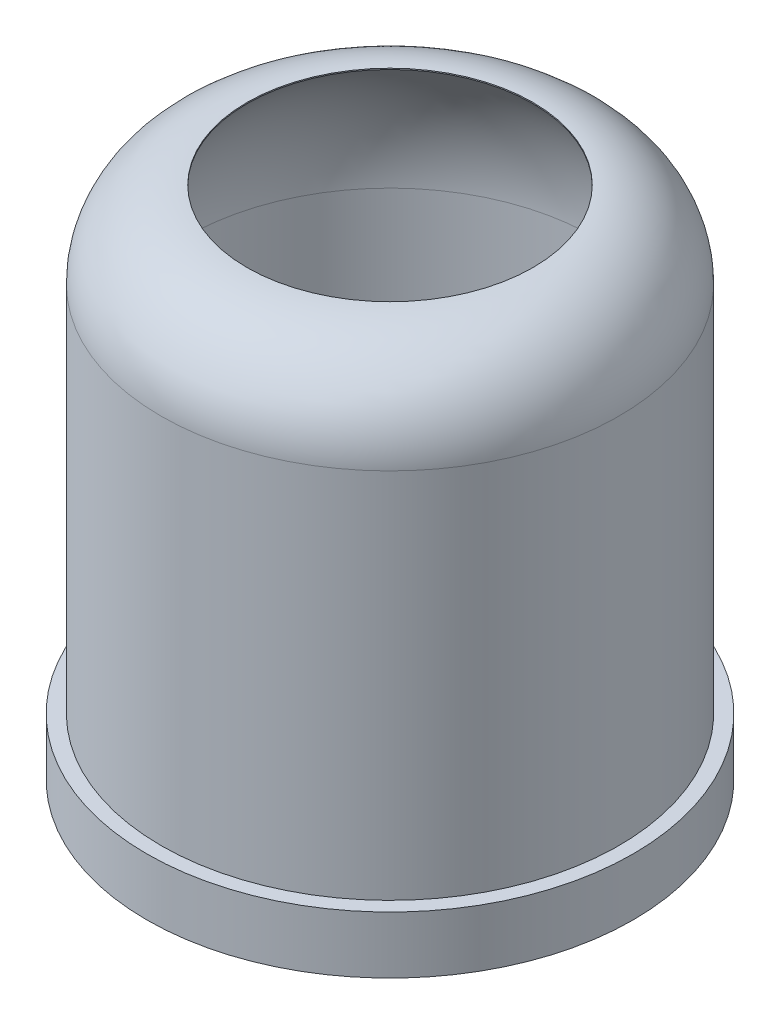
ISO-10303-21;
HEADER;
FILE_DESCRIPTION(('STEP AP214'),'2;1');
FILE_NAME('part.step','',(''),(''),'','','');
FILE_SCHEMA(('AUTOMOTIVE_DESIGN { 1 0 10303 214 1 1 1 1 }'));
ENDSEC;
DATA;
#1=APPLICATION_CONTEXT('core data for automotive mechanical design processes');
#2=APPLICATION_PROTOCOL_DEFINITION('international standard','automotive_design',2000,#1);
#3=PRODUCT_CONTEXT('',#1,'mechanical');
#4=PRODUCT('Part','Part','',(#3));
#5=PRODUCT_RELATED_PRODUCT_CATEGORY('part','',(#4));
#6=PRODUCT_DEFINITION_FORMATION('','',#4);
#7=PRODUCT_DEFINITION_CONTEXT('part definition',#1,'design');
#8=PRODUCT_DEFINITION('design','',#6,#7);
#9=PRODUCT_DEFINITION_SHAPE('','',#8);
#10=(LENGTH_UNIT() NAMED_UNIT(*) SI_UNIT(.MILLI.,.METRE.));
#11=(NAMED_UNIT(*) PLANE_ANGLE_UNIT() SI_UNIT($,.RADIAN.));
#12=(NAMED_UNIT(*) SI_UNIT($,.STERADIAN.) SOLID_ANGLE_UNIT());
#13=UNCERTAINTY_MEASURE_WITH_UNIT(LENGTH_MEASURE(1.E-05),#10,'distance_accuracy_value','');
#14=(GEOMETRIC_REPRESENTATION_CONTEXT(3) GLOBAL_UNCERTAINTY_ASSIGNED_CONTEXT((#13)) GLOBAL_UNIT_ASSIGNED_CONTEXT((#10,
#11,#12)) REPRESENTATION_CONTEXT('',''));
#15=CARTESIAN_POINT('',(0.,0.,0.));
#16=DIRECTION('',(0.,0.,1.));
#17=DIRECTION('',(1.,0.,0.));
#18=AXIS2_PLACEMENT_3D('',#15,#16,#17);
#19=CARTESIAN_POINT('',(0.,4.5,0.));
#20=DIRECTION('',(0.,1.,0.));
#21=DIRECTION('',(0.,0.,1.));
#22=AXIS2_PLACEMENT_3D('',#19,#20,#21);
#23=CYLINDRICAL_SURFACE('',#22,4.25);
#24=CARTESIAN_POINT('',(0.,-4.5,0.));
#25=DIRECTION('',(0.,1.,0.));
#26=DIRECTION('',(0.,0.,1.));
#27=AXIS2_PLACEMENT_3D('',#24,#25,#26);
#28=CIRCLE('',#27,4.25);
#29=CARTESIAN_POINT('',(0.,-4.5,4.25));
#30=VERTEX_POINT('',#29);
#31=EDGE_CURVE('E59',#30,#30,#28,.T.);
#32=ORIENTED_EDGE('',*,*,#31,.T.);
#33=EDGE_LOOP('',(#32));
#34=FACE_BOUND('',#33,.T.);
#35=CARTESIAN_POINT('',(0.,-3.5,0.));
#36=DIRECTION('',(0.,1.,0.));
#37=DIRECTION('',(0.,0.,1.));
#38=AXIS2_PLACEMENT_3D('',#35,#36,#37);
#39=CIRCLE('',#38,4.25);
#40=CARTESIAN_POINT('',(0.,-3.5,4.25));
#41=VERTEX_POINT('',#40);
#42=EDGE_CURVE('E10',#41,#41,#39,.T.);
#43=ORIENTED_EDGE('',*,*,#42,.F.);
#44=EDGE_LOOP('',(#43));
#45=FACE_BOUND('',#44,.T.);
#46=ADVANCED_FACE('F28',(#34,#45),#23,.T.);
#47=CARTESIAN_POINT('',(-4.25,-3.5,0.));
#48=DIRECTION('',(0.,1.,0.));
#49=DIRECTION('',(0.,0.,1.));
#50=AXIS2_PLACEMENT_3D('',#47,#48,#49);
#51=PLANE('',#50);
#52=ORIENTED_EDGE('',*,*,#42,.T.);
#53=EDGE_LOOP('',(#52));
#54=FACE_BOUND('',#53,.T.);
#55=CARTESIAN_POINT('',(0.,-3.5,0.));
#56=DIRECTION('',(0.,1.,0.));
#57=DIRECTION('',(0.,0.,1.));
#58=AXIS2_PLACEMENT_3D('',#55,#56,#57);
#59=CIRCLE('',#58,4.);
#60=CARTESIAN_POINT('',(0.,-3.5,4.));
#61=VERTEX_POINT('',#60);
#62=EDGE_CURVE('E34',#61,#61,#59,.T.);
#63=ORIENTED_EDGE('',*,*,#62,.F.);
#64=EDGE_LOOP('',(#63));
#65=FACE_BOUND('',#64,.T.);
#66=ADVANCED_FACE('F77',(#54,#65),#51,.T.);
#67=CARTESIAN_POINT('',(0.,4.5,0.));
#68=DIRECTION('',(0.,1.,0.));
#69=DIRECTION('',(0.,0.,1.));
#70=AXIS2_PLACEMENT_3D('',#67,#68,#69);
#71=CYLINDRICAL_SURFACE('',#70,4.);
#72=ORIENTED_EDGE('',*,*,#62,.T.);
#73=EDGE_LOOP('',(#72));
#74=FACE_BOUND('',#73,.T.);
#75=CARTESIAN_POINT('',(0.,3.,0.));
#76=DIRECTION('',(0.,1.,0.));
#77=DIRECTION('',(0.,0.,1.));
#78=AXIS2_PLACEMENT_3D('',#75,#76,#77);
#79=CIRCLE('',#78,4.);
#80=CARTESIAN_POINT('',(0.,3.,4.));
#81=VERTEX_POINT('',#80);
#82=EDGE_CURVE('E38',#81,#81,#79,.T.);
#83=ORIENTED_EDGE('',*,*,#82,.F.);
#84=EDGE_LOOP('',(#83));
#85=FACE_BOUND('',#84,.T.);
#86=ADVANCED_FACE('F81',(#74,#85),#71,.T.);
#87=CARTESIAN_POINT('',(0.,3.,0.));
#88=DIRECTION('',(0.,1.,0.));
#89=DIRECTION('',(0.,0.,1.));
#90=AXIS2_PLACEMENT_3D('',#87,#88,#89);
#91=TOROIDAL_SURFACE('',#90,2.5,1.5);
#92=ORIENTED_EDGE('',*,*,#82,.T.);
#93=EDGE_LOOP('',(#92));
#94=FACE_BOUND('',#93,.T.);
#95=CARTESIAN_POINT('',(0.,4.5,0.));
#96=DIRECTION('',(0.,1.,0.));
#97=DIRECTION('',(0.,0.,1.));
#98=AXIS2_PLACEMENT_3D('',#95,#96,#97);
#99=CIRCLE('',#98,2.5);
#100=CARTESIAN_POINT('',(0.,4.5,2.5));
#101=VERTEX_POINT('',#100);
#102=EDGE_CURVE('E42',#101,#101,#99,.T.);
#103=ORIENTED_EDGE('',*,*,#102,.F.);
#104=EDGE_LOOP('',(#103));
#105=FACE_BOUND('',#104,.T.);
#106=ADVANCED_FACE('F85',(#94,#105),#91,.T.);
#107=CARTESIAN_POINT('',(0.,4.5,0.));
#108=DIRECTION('',(0.,1.,0.));
#109=DIRECTION('',(0.,0.,1.));
#110=AXIS2_PLACEMENT_3D('',#107,#108,#109);
#111=CYLINDRICAL_SURFACE('',#110,2.5);
#112=ORIENTED_EDGE('',*,*,#102,.T.);
#113=EDGE_LOOP('',(#112));
#114=FACE_BOUND('',#113,.T.);
#115=CARTESIAN_POINT('',(0.,4.48050875561012,0.));
#116=DIRECTION('',(0.,1.,0.));
#117=DIRECTION('',(0.,0.,1.));
#118=AXIS2_PLACEMENT_3D('',#115,#116,#117);
#119=CIRCLE('',#118,2.5);
#120=CARTESIAN_POINT('',(0.,4.48050875561012,2.5));
#121=VERTEX_POINT('',#120);
#122=EDGE_CURVE('E47',#121,#121,#119,.T.);
#123=ORIENTED_EDGE('',*,*,#122,.F.);
#124=EDGE_LOOP('',(#123));
#125=FACE_BOUND('',#124,.T.);
#126=ADVANCED_FACE('F91',(#114,#125),#111,.F.);
#127=CARTESIAN_POINT('',(0.,1.925,0.));
#128=DIRECTION('',(0.,1.,0.));
#129=DIRECTION('',(-1.,0.,0.));
#130=AXIS2_PLACEMENT_3D('',#127,#128,#129);
#131=SPHERICAL_SURFACE('',#130,3.575);
#132=ORIENTED_EDGE('',*,*,#122,.T.);
#133=EDGE_LOOP('',(#132));
#134=FACE_BOUND('',#133,.T.);
#135=CARTESIAN_POINT('',(0.,1.92499999999997,0.));
#136=DIRECTION('',(0.,1.,0.));
#137=DIRECTION('',(0.,0.,1.));
#138=AXIS2_PLACEMENT_3D('',#135,#136,#137);
#139=CIRCLE('',#138,3.575);
#140=CARTESIAN_POINT('',(0.,1.92499999999997,3.575));
#141=VERTEX_POINT('',#140);
#142=EDGE_CURVE('E50',#141,#141,#139,.T.);
#143=ORIENTED_EDGE('',*,*,#142,.F.);
#144=EDGE_LOOP('',(#143));
#145=FACE_BOUND('',#144,.T.);
#146=ADVANCED_FACE('F95',(#134,#145),#131,.F.);
#147=CARTESIAN_POINT('',(0.,4.5,0.));
#148=DIRECTION('',(0.,1.,0.));
#149=DIRECTION('',(0.,0.,1.));
#150=AXIS2_PLACEMENT_3D('',#147,#148,#149);
#151=CYLINDRICAL_SURFACE('',#150,3.575);
#152=ORIENTED_EDGE('',*,*,#142,.T.);
#153=EDGE_LOOP('',(#152));
#154=FACE_BOUND('',#153,.T.);
#155=CARTESIAN_POINT('',(0.,-2.76362446458147,0.));
#156=DIRECTION('',(0.,1.,0.));
#157=DIRECTION('',(0.,0.,1.));
#158=AXIS2_PLACEMENT_3D('',#155,#156,#157);
#159=CIRCLE('',#158,3.575);
#160=CARTESIAN_POINT('',(0.,-2.76362446458147,3.575));
#161=VERTEX_POINT('',#160);
#162=EDGE_CURVE('E53',#161,#161,#159,.T.);
#163=ORIENTED_EDGE('',*,*,#162,.F.);
#164=EDGE_LOOP('',(#163));
#165=FACE_BOUND('',#164,.T.);
#166=ADVANCED_FACE('F73',(#154,#165),#151,.F.);
#167=CARTESIAN_POINT('',(0.,-2.76362446458147,0.));
#168=DIRECTION('',(0.,1.,0.));
#169=DIRECTION('',(-1.,0.,0.));
#170=AXIS2_PLACEMENT_3D('',#167,#168,#169);
#171=SPHERICAL_SURFACE('',#170,3.575);
#172=ORIENTED_EDGE('',*,*,#162,.T.);
#173=EDGE_LOOP('',(#172));
#174=FACE_BOUND('',#173,.T.);
#175=CARTESIAN_POINT('',(0.,-4.5,0.));
#176=DIRECTION('',(0.,1.,0.));
#177=DIRECTION('',(0.,0.,1.));
#178=AXIS2_PLACEMENT_3D('',#175,#176,#177);
#179=CIRCLE('',#178,3.125);
#180=CARTESIAN_POINT('',(0.,-4.5,3.125));
#181=VERTEX_POINT('',#180);
#182=EDGE_CURVE('E56',#181,#181,#179,.T.);
#183=ORIENTED_EDGE('',*,*,#182,.F.);
#184=EDGE_LOOP('',(#183));
#185=FACE_BOUND('',#184,.T.);
#186=ADVANCED_FACE('F67',(#174,#185),#171,.F.);
#187=CARTESIAN_POINT('',(-3.125,-4.5,0.));
#188=DIRECTION('',(0.,-1.,0.));
#189=DIRECTION('',(0.,0.,-1.));
#190=AXIS2_PLACEMENT_3D('',#187,#188,#189);
#191=PLANE('',#190);
#192=ORIENTED_EDGE('',*,*,#182,.T.);
#193=EDGE_LOOP('',(#192));
#194=FACE_BOUND('',#193,.T.);
#195=ORIENTED_EDGE('',*,*,#31,.F.);
#196=EDGE_LOOP('',(#195));
#197=FACE_BOUND('',#196,.T.);
#198=ADVANCED_FACE('F65',(#194,#197),#191,.T.);
#199=CLOSED_SHELL('',(#46,#66,#86,#106,#126,#146,#166,#186,#198));
#200=MANIFOLD_SOLID_BREP('B2',#199);
#201=ADVANCED_BREP_SHAPE_REPRESENTATION('',(#18,#200),#14);
#202=SHAPE_DEFINITION_REPRESENTATION(#9,#201);
ENDSEC;
END-ISO-10303-21;
